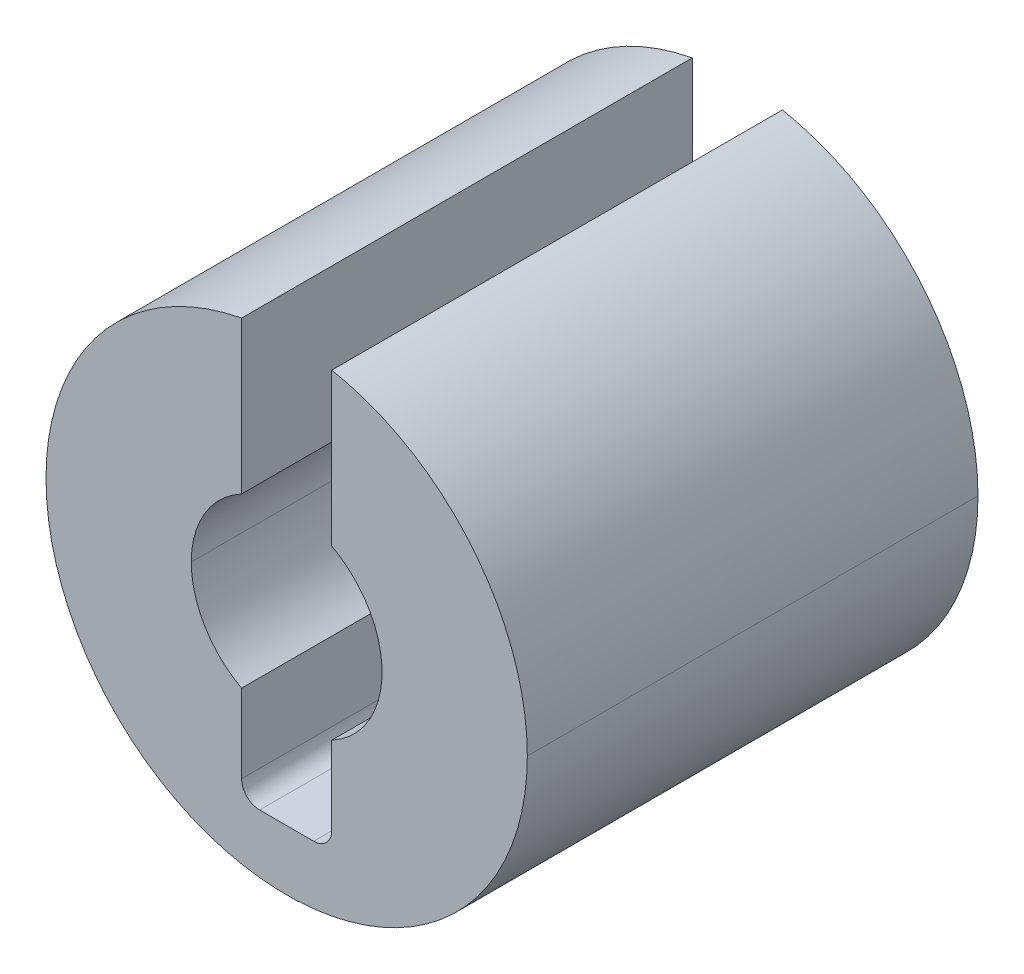
ISO-10303-21;
HEADER;
FILE_DESCRIPTION(('STEP AP214'),'2;1');
FILE_NAME('part.step','',(''),(''),'','','');
FILE_SCHEMA(('AUTOMOTIVE_DESIGN { 1 0 10303 214 1 1 1 1 }'));
ENDSEC;
DATA;
#1=APPLICATION_CONTEXT('core data for automotive mechanical design processes');
#2=APPLICATION_PROTOCOL_DEFINITION('international standard','automotive_design',2000,#1);
#3=PRODUCT_CONTEXT('',#1,'mechanical');
#4=PRODUCT('Part','Part','',(#3));
#5=PRODUCT_RELATED_PRODUCT_CATEGORY('part','',(#4));
#6=PRODUCT_DEFINITION_FORMATION('','',#4);
#7=PRODUCT_DEFINITION_CONTEXT('part definition',#1,'design');
#8=PRODUCT_DEFINITION('design','',#6,#7);
#9=PRODUCT_DEFINITION_SHAPE('','',#8);
#10=(LENGTH_UNIT() NAMED_UNIT(*) SI_UNIT(.MILLI.,.METRE.));
#11=(NAMED_UNIT(*) PLANE_ANGLE_UNIT() SI_UNIT($,.RADIAN.));
#12=(NAMED_UNIT(*) SI_UNIT($,.STERADIAN.) SOLID_ANGLE_UNIT());
#13=UNCERTAINTY_MEASURE_WITH_UNIT(LENGTH_MEASURE(1.E-05),#10,'distance_accuracy_value','');
#14=(GEOMETRIC_REPRESENTATION_CONTEXT(3) GLOBAL_UNCERTAINTY_ASSIGNED_CONTEXT((#13)) GLOBAL_UNIT_ASSIGNED_CONTEXT((#10,
#11,#12)) REPRESENTATION_CONTEXT('',''));
#15=CARTESIAN_POINT('',(0.,0.,0.));
#16=DIRECTION('',(0.,0.,1.));
#17=DIRECTION('',(1.,0.,0.));
#18=AXIS2_PLACEMENT_3D('',#15,#16,#17);
#19=CARTESIAN_POINT('',(0.45,-2.705,7.5));
#20=DIRECTION('',(0.,0.,1.));
#21=DIRECTION('',(1.,0.,0.));
#22=AXIS2_PLACEMENT_3D('',#19,#20,#21);
#23=CYLINDRICAL_SURFACE('',#22,0.3);
#24=CARTESIAN_POINT('',(0.45,-2.705,7.5));
#25=DIRECTION('',(0.,0.,-1.));
#26=DIRECTION('',(1.,0.,0.));
#27=AXIS2_PLACEMENT_3D('',#24,#25,#26);
#28=CIRCLE('',#27,0.3);
#29=CARTESIAN_POINT('',(0.75,-2.705,7.5));
#30=VERTEX_POINT('',#29);
#31=CARTESIAN_POINT('',(0.45,-3.005,7.5));
#32=VERTEX_POINT('',#31);
#33=EDGE_CURVE('E431',#30,#32,#28,.T.);
#34=ORIENTED_EDGE('',*,*,#33,.F.);
#35=DIRECTION('',(0.,0.,1.));
#36=VECTOR('',#35,1.);
#37=CARTESIAN_POINT('',(0.75,-2.705,7.5));
#38=LINE('',#37,#36);
#39=CARTESIAN_POINT('',(0.75,-2.705,0.));
#40=VERTEX_POINT('',#39);
#41=EDGE_CURVE('E302',#40,#30,#38,.T.);
#42=ORIENTED_EDGE('',*,*,#41,.F.);
#43=CARTESIAN_POINT('',(0.45,-2.705,0.));
#44=DIRECTION('',(0.,0.,1.));
#45=DIRECTION('',(1.,0.,0.));
#46=AXIS2_PLACEMENT_3D('',#43,#44,#45);
#47=CIRCLE('',#46,0.3);
#48=CARTESIAN_POINT('',(0.45,-3.005,0.));
#49=VERTEX_POINT('',#48);
#50=EDGE_CURVE('E11',#49,#40,#47,.T.);
#51=ORIENTED_EDGE('',*,*,#50,.F.);
#52=DIRECTION('',(0.,0.,-1.));
#53=VECTOR('',#52,1.);
#54=CARTESIAN_POINT('',(0.45,-3.005,0.));
#55=LINE('',#54,#53);
#56=EDGE_CURVE('E337',#32,#49,#55,.T.);
#57=ORIENTED_EDGE('',*,*,#56,.F.);
#58=EDGE_LOOP('',(#34,#42,#51,#57));
#59=FACE_BOUND('',#58,.T.);
#60=ADVANCED_FACE('F17',(#59),#23,.F.);
#61=CARTESIAN_POINT('',(-0.45,-2.705,7.5));
#62=DIRECTION('',(0.,0.,1.));
#63=DIRECTION('',(1.,0.,0.));
#64=AXIS2_PLACEMENT_3D('',#61,#62,#63);
#65=CYLINDRICAL_SURFACE('',#64,0.3);
#66=CARTESIAN_POINT('',(-0.45,-2.705,7.5));
#67=DIRECTION('',(0.,0.,-1.));
#68=DIRECTION('',(1.,0.,0.));
#69=AXIS2_PLACEMENT_3D('',#66,#67,#68);
#70=CIRCLE('',#69,0.3);
#71=CARTESIAN_POINT('',(-0.45,-3.005,7.5));
#72=VERTEX_POINT('',#71);
#73=CARTESIAN_POINT('',(-0.75,-2.705,7.5));
#74=VERTEX_POINT('',#73);
#75=EDGE_CURVE('E437',#72,#74,#70,.T.);
#76=ORIENTED_EDGE('',*,*,#75,.F.);
#77=DIRECTION('',(0.,0.,1.));
#78=VECTOR('',#77,1.);
#79=CARTESIAN_POINT('',(-0.45,-3.005,7.5));
#80=LINE('',#79,#78);
#81=CARTESIAN_POINT('',(-0.45,-3.005,0.));
#82=VERTEX_POINT('',#81);
#83=EDGE_CURVE('E323',#82,#72,#80,.T.);
#84=ORIENTED_EDGE('',*,*,#83,.F.);
#85=CARTESIAN_POINT('',(-0.45,-2.705,0.));
#86=DIRECTION('',(0.,0.,1.));
#87=DIRECTION('',(1.,0.,0.));
#88=AXIS2_PLACEMENT_3D('',#85,#86,#87);
#89=CIRCLE('',#88,0.3);
#90=CARTESIAN_POINT('',(-0.75,-2.705,0.));
#91=VERTEX_POINT('',#90);
#92=EDGE_CURVE('E27',#91,#82,#89,.T.);
#93=ORIENTED_EDGE('',*,*,#92,.F.);
#94=DIRECTION('',(0.,0.,-1.));
#95=VECTOR('',#94,1.);
#96=CARTESIAN_POINT('',(-0.75,-2.705,0.));
#97=LINE('',#96,#95);
#98=EDGE_CURVE('E351',#74,#91,#97,.T.);
#99=ORIENTED_EDGE('',*,*,#98,.F.);
#100=EDGE_LOOP('',(#76,#84,#93,#99));
#101=FACE_BOUND('',#100,.T.);
#102=ADVANCED_FACE('F584',(#101),#65,.F.);
#103=CARTESIAN_POINT('',(0.,0.,0.));
#104=DIRECTION('',(0.,0.,1.));
#105=DIRECTION('',(1.,0.,0.));
#106=AXIS2_PLACEMENT_3D('',#103,#104,#105);
#107=PLANE('',#106);
#108=CARTESIAN_POINT('',(0.,0.,0.));
#109=DIRECTION('',(0.,0.,-1.));
#110=DIRECTION('',(1.,0.,0.));
#111=AXIS2_PLACEMENT_3D('',#108,#109,#110);
#112=CIRCLE('',#111,1.5875);
#113=CARTESIAN_POINT('',(0.75,1.3991626960436,0.));
#114=VERTEX_POINT('',#113);
#115=CARTESIAN_POINT('',(0.75,-1.3991626960436,0.));
#116=VERTEX_POINT('',#115);
#117=EDGE_CURVE('E260',#114,#116,#112,.T.);
#118=ORIENTED_EDGE('',*,*,#117,.F.);
#119=DIRECTION('',(0.,-1.,0.));
#120=VECTOR('',#119,1.);
#121=CARTESIAN_POINT('',(0.75,1.3991626960436,0.));
#122=LINE('',#121,#120);
#123=CARTESIAN_POINT('',(0.75,3.93414857370689,0.));
#124=VERTEX_POINT('',#123);
#125=EDGE_CURVE('E420',#124,#114,#122,.T.);
#126=ORIENTED_EDGE('',*,*,#125,.F.);
#127=CARTESIAN_POINT('',(0.,0.,0.));
#128=DIRECTION('',(0.,0.,1.));
#129=DIRECTION('',(1.,0.,0.));
#130=AXIS2_PLACEMENT_3D('',#127,#128,#129);
#131=CIRCLE('',#130,4.005);
#132=CARTESIAN_POINT('',(4.005,0.,0.));
#133=VERTEX_POINT('',#132);
#134=EDGE_CURVE('E174',#133,#124,#131,.T.);
#135=ORIENTED_EDGE('',*,*,#134,.F.);
#136=CARTESIAN_POINT('',(0.,0.,0.));
#137=DIRECTION('',(0.,0.,1.));
#138=DIRECTION('',(1.,0.,0.));
#139=AXIS2_PLACEMENT_3D('',#136,#137,#138);
#140=CIRCLE('',#139,4.005);
#141=CARTESIAN_POINT('',(-4.005,0.,0.));
#142=VERTEX_POINT('',#141);
#143=EDGE_CURVE('E169',#142,#133,#140,.T.);
#144=ORIENTED_EDGE('',*,*,#143,.F.);
#145=CARTESIAN_POINT('',(0.,0.,0.));
#146=DIRECTION('',(0.,0.,1.));
#147=DIRECTION('',(1.,0.,0.));
#148=AXIS2_PLACEMENT_3D('',#145,#146,#147);
#149=CIRCLE('',#148,4.005);
#150=CARTESIAN_POINT('',(-0.75,3.93414857370689,0.));
#151=VERTEX_POINT('',#150);
#152=EDGE_CURVE('E55',#151,#142,#149,.T.);
#153=ORIENTED_EDGE('',*,*,#152,.F.);
#154=DIRECTION('',(0.,1.,0.));
#155=VECTOR('',#154,1.);
#156=CARTESIAN_POINT('',(-0.75,1.3991626960436,0.));
#157=LINE('',#156,#155);
#158=CARTESIAN_POINT('',(-0.75,1.3991626960436,0.));
#159=VERTEX_POINT('',#158);
#160=EDGE_CURVE('E388',#159,#151,#157,.T.);
#161=ORIENTED_EDGE('',*,*,#160,.F.);
#162=CARTESIAN_POINT('',(0.,0.,0.));
#163=DIRECTION('',(0.,0.,-1.));
#164=DIRECTION('',(1.,0.,0.));
#165=AXIS2_PLACEMENT_3D('',#162,#163,#164);
#166=CIRCLE('',#165,1.5875);
#167=CARTESIAN_POINT('',(-1.5875,0.,0.));
#168=VERTEX_POINT('',#167);
#169=EDGE_CURVE('E242',#168,#159,#166,.T.);
#170=ORIENTED_EDGE('',*,*,#169,.F.);
#171=CARTESIAN_POINT('',(0.,0.,0.));
#172=DIRECTION('',(0.,0.,-1.));
#173=DIRECTION('',(1.,0.,0.));
#174=AXIS2_PLACEMENT_3D('',#171,#172,#173);
#175=CIRCLE('',#174,1.5875);
#176=CARTESIAN_POINT('',(-0.75,-1.3991626960436,0.));
#177=VERTEX_POINT('',#176);
#178=EDGE_CURVE('E380',#177,#168,#175,.T.);
#179=ORIENTED_EDGE('',*,*,#178,.F.);
#180=DIRECTION('',(0.,1.,0.));
#181=VECTOR('',#180,1.);
#182=CARTESIAN_POINT('',(-0.75,-3.005,0.));
#183=LINE('',#182,#181);
#184=EDGE_CURVE('E358',#91,#177,#183,.T.);
#185=ORIENTED_EDGE('',*,*,#184,.F.);
#186=ORIENTED_EDGE('',*,*,#92,.T.);
#187=DIRECTION('',(-1.,0.,0.));
#188=VECTOR('',#187,1.);
#189=CARTESIAN_POINT('',(-0.75,-3.005,0.));
#190=LINE('',#189,#188);
#191=EDGE_CURVE('E316',#49,#82,#190,.T.);
#192=ORIENTED_EDGE('',*,*,#191,.F.);
#193=ORIENTED_EDGE('',*,*,#50,.T.);
#194=DIRECTION('',(0.,-1.,0.));
#195=VECTOR('',#194,1.);
#196=CARTESIAN_POINT('',(0.75,-3.005,0.));
#197=LINE('',#196,#195);
#198=EDGE_CURVE('E295',#116,#40,#197,.T.);
#199=ORIENTED_EDGE('',*,*,#198,.F.);
#200=EDGE_LOOP('',(#118,#126,#135,#144,#153,#161,#170,#179,#185,#186,#192,#193,#199));
#201=FACE_BOUND('',#200,.T.);
#202=ADVANCED_FACE('F575',(#201),#107,.F.);
#203=CARTESIAN_POINT('',(0.,0.,7.5));
#204=DIRECTION('',(0.,0.,1.));
#205=DIRECTION('',(1.,0.,0.));
#206=AXIS2_PLACEMENT_3D('',#203,#204,#205);
#207=PLANE('',#206);
#208=CARTESIAN_POINT('',(0.,0.,7.5));
#209=DIRECTION('',(0.,0.,-1.));
#210=DIRECTION('',(1.,0.,0.));
#211=AXIS2_PLACEMENT_3D('',#208,#209,#210);
#212=CIRCLE('',#211,1.5875);
#213=CARTESIAN_POINT('',(0.75,1.3991626960436,7.5));
#214=VERTEX_POINT('',#213);
#215=CARTESIAN_POINT('',(0.75,-1.3991626960436,7.5));
#216=VERTEX_POINT('',#215);
#217=EDGE_CURVE('E279',#214,#216,#212,.T.);
#218=ORIENTED_EDGE('',*,*,#217,.T.);
#219=DIRECTION('',(0.,-1.,0.));
#220=VECTOR('',#219,1.);
#221=CARTESIAN_POINT('',(0.75,-3.005,7.5));
#222=LINE('',#221,#220);
#223=EDGE_CURVE('E309',#216,#30,#222,.T.);
#224=ORIENTED_EDGE('',*,*,#223,.T.);
#225=ORIENTED_EDGE('',*,*,#33,.T.);
#226=DIRECTION('',(-1.,0.,0.));
#227=VECTOR('',#226,1.);
#228=CARTESIAN_POINT('',(-0.75,-3.005,7.5));
#229=LINE('',#228,#227);
#230=EDGE_CURVE('E331',#32,#72,#229,.T.);
#231=ORIENTED_EDGE('',*,*,#230,.T.);
#232=ORIENTED_EDGE('',*,*,#75,.T.);
#233=DIRECTION('',(0.,1.,0.));
#234=VECTOR('',#233,1.);
#235=CARTESIAN_POINT('',(-0.75,-3.005,7.5));
#236=LINE('',#235,#234);
#237=CARTESIAN_POINT('',(-0.75,-1.3991626960436,7.5));
#238=VERTEX_POINT('',#237);
#239=EDGE_CURVE('E344',#74,#238,#236,.T.);
#240=ORIENTED_EDGE('',*,*,#239,.T.);
#241=CARTESIAN_POINT('',(0.,0.,7.5));
#242=DIRECTION('',(0.,0.,-1.));
#243=DIRECTION('',(1.,0.,0.));
#244=AXIS2_PLACEMENT_3D('',#241,#242,#243);
#245=CIRCLE('',#244,1.5875);
#246=CARTESIAN_POINT('',(-1.5875,0.,7.5));
#247=VERTEX_POINT('',#246);
#248=EDGE_CURVE('E372',#238,#247,#245,.T.);
#249=ORIENTED_EDGE('',*,*,#248,.T.);
#250=CARTESIAN_POINT('',(0.,0.,7.5));
#251=DIRECTION('',(0.,0.,-1.));
#252=DIRECTION('',(1.,0.,0.));
#253=AXIS2_PLACEMENT_3D('',#250,#251,#252);
#254=CIRCLE('',#253,1.5875);
#255=CARTESIAN_POINT('',(-0.75,1.3991626960436,7.5));
#256=VERTEX_POINT('',#255);
#257=EDGE_CURVE('E223',#247,#256,#254,.T.);
#258=ORIENTED_EDGE('',*,*,#257,.T.);
#259=DIRECTION('',(0.,1.,0.));
#260=VECTOR('',#259,1.);
#261=CARTESIAN_POINT('',(-0.75,1.3991626960436,7.5));
#262=LINE('',#261,#260);
#263=CARTESIAN_POINT('',(-0.75,3.93414857370689,7.5));
#264=VERTEX_POINT('',#263);
#265=EDGE_CURVE('E403',#256,#264,#262,.T.);
#266=ORIENTED_EDGE('',*,*,#265,.T.);
#267=CARTESIAN_POINT('',(0.,0.,7.5));
#268=DIRECTION('',(0.,0.,1.));
#269=DIRECTION('',(1.,0.,0.));
#270=AXIS2_PLACEMENT_3D('',#267,#268,#269);
#271=CIRCLE('',#270,4.005);
#272=CARTESIAN_POINT('',(-4.005,0.,7.5));
#273=VERTEX_POINT('',#272);
#274=EDGE_CURVE('E41',#264,#273,#271,.T.);
#275=ORIENTED_EDGE('',*,*,#274,.T.);
#276=CARTESIAN_POINT('',(0.,0.,7.5));
#277=DIRECTION('',(0.,0.,1.));
#278=DIRECTION('',(1.,0.,0.));
#279=AXIS2_PLACEMENT_3D('',#276,#277,#278);
#280=CIRCLE('',#279,4.005);
#281=CARTESIAN_POINT('',(4.005,0.,7.5));
#282=VERTEX_POINT('',#281);
#283=EDGE_CURVE('E155',#273,#282,#280,.T.);
#284=ORIENTED_EDGE('',*,*,#283,.T.);
#285=CARTESIAN_POINT('',(0.,0.,7.5));
#286=DIRECTION('',(0.,0.,1.));
#287=DIRECTION('',(1.,0.,0.));
#288=AXIS2_PLACEMENT_3D('',#285,#286,#287);
#289=CIRCLE('',#288,4.005);
#290=CARTESIAN_POINT('',(0.75,3.93414857370689,7.5));
#291=VERTEX_POINT('',#290);
#292=EDGE_CURVE('E21',#282,#291,#289,.T.);
#293=ORIENTED_EDGE('',*,*,#292,.T.);
#294=DIRECTION('',(0.,-1.,0.));
#295=VECTOR('',#294,1.);
#296=CARTESIAN_POINT('',(0.75,1.3991626960436,7.5));
#297=LINE('',#296,#295);
#298=EDGE_CURVE('E148',#291,#214,#297,.T.);
#299=ORIENTED_EDGE('',*,*,#298,.T.);
#300=EDGE_LOOP('',(#218,#224,#225,#231,#232,#240,#249,#258,#266,#275,#284,#293,#299));
#301=FACE_BOUND('',#300,.T.);
#302=ADVANCED_FACE('F158',(#301),#207,.T.);
#303=CARTESIAN_POINT('',(0.75,1.3991626960436,7.5));
#304=DIRECTION('',(1.,0.,0.));
#305=DIRECTION('',(0.,1.,0.));
#306=AXIS2_PLACEMENT_3D('',#303,#304,#305);
#307=PLANE('',#306);
#308=ORIENTED_EDGE('',*,*,#125,.T.);
#309=DIRECTION('',(0.,0.,-1.));
#310=VECTOR('',#309,1.);
#311=CARTESIAN_POINT('',(0.75,1.3991626960436,7.5));
#312=LINE('',#311,#310);
#313=EDGE_CURVE('E287',#214,#114,#312,.T.);
#314=ORIENTED_EDGE('',*,*,#313,.F.);
#315=ORIENTED_EDGE('',*,*,#298,.F.);
#316=DIRECTION('',(0.,0.,-1.));
#317=VECTOR('',#316,1.);
#318=CARTESIAN_POINT('',(0.75,3.93414857370689,7.5));
#319=LINE('',#318,#317);
#320=EDGE_CURVE('E164',#291,#124,#319,.T.);
#321=ORIENTED_EDGE('',*,*,#320,.T.);
#322=EDGE_LOOP('',(#308,#314,#315,#321));
#323=FACE_BOUND('',#322,.T.);
#324=ADVANCED_FACE('F557',(#323),#307,.F.);
#325=CARTESIAN_POINT('',(0.,0.,7.5));
#326=DIRECTION('',(0.,0.,-1.));
#327=DIRECTION('',(-1.,0.,0.));
#328=AXIS2_PLACEMENT_3D('',#325,#326,#327);
#329=CYLINDRICAL_SURFACE('',#328,4.005);
#330=DIRECTION('',(0.,0.,-1.));
#331=VECTOR('',#330,1.);
#332=CARTESIAN_POINT('',(-4.005,0.,7.5));
#333=LINE('',#332,#331);
#334=EDGE_CURVE('E163',#273,#142,#333,.T.);
#335=ORIENTED_EDGE('',*,*,#334,.F.);
#336=ORIENTED_EDGE('',*,*,#274,.F.);
#337=DIRECTION('',(0.,0.,-1.));
#338=VECTOR('',#337,1.);
#339=CARTESIAN_POINT('',(-0.75,3.93414857370689,7.5));
#340=LINE('',#339,#338);
#341=EDGE_CURVE('E396',#264,#151,#340,.T.);
#342=ORIENTED_EDGE('',*,*,#341,.T.);
#343=ORIENTED_EDGE('',*,*,#152,.T.);
#344=EDGE_LOOP('',(#335,#336,#342,#343));
#345=FACE_BOUND('',#344,.T.);
#346=ADVANCED_FACE('F546',(#345),#329,.T.);
#347=CARTESIAN_POINT('',(-0.75,1.3991626960436,7.5));
#348=DIRECTION('',(-1.,0.,0.));
#349=DIRECTION('',(0.,0.,1.));
#350=AXIS2_PLACEMENT_3D('',#347,#348,#349);
#351=PLANE('',#350);
#352=ORIENTED_EDGE('',*,*,#160,.T.);
#353=ORIENTED_EDGE('',*,*,#341,.F.);
#354=ORIENTED_EDGE('',*,*,#265,.F.);
#355=DIRECTION('',(0.,0.,-1.));
#356=VECTOR('',#355,1.);
#357=CARTESIAN_POINT('',(-0.75,1.3991626960436,7.5));
#358=LINE('',#357,#356);
#359=EDGE_CURVE('E251',#256,#159,#358,.T.);
#360=ORIENTED_EDGE('',*,*,#359,.T.);
#361=EDGE_LOOP('',(#352,#353,#354,#360));
#362=FACE_BOUND('',#361,.T.);
#363=ADVANCED_FACE('F535',(#362),#351,.F.);
#364=CARTESIAN_POINT('',(0.,0.,7.5));
#365=DIRECTION('',(0.,0.,-1.));
#366=DIRECTION('',(-1.,0.,0.));
#367=AXIS2_PLACEMENT_3D('',#364,#365,#366);
#368=CYLINDRICAL_SURFACE('',#367,1.5875);
#369=DIRECTION('',(0.,0.,-1.));
#370=VECTOR('',#369,1.);
#371=CARTESIAN_POINT('',(-1.5875,0.,7.5));
#372=LINE('',#371,#370);
#373=EDGE_CURVE('E232',#247,#168,#372,.T.);
#374=ORIENTED_EDGE('',*,*,#373,.F.);
#375=ORIENTED_EDGE('',*,*,#248,.F.);
#376=DIRECTION('',(0.,0.,-1.));
#377=VECTOR('',#376,1.);
#378=CARTESIAN_POINT('',(-0.75,-1.3991626960436,7.5));
#379=LINE('',#378,#377);
#380=EDGE_CURVE('E365',#238,#177,#379,.T.);
#381=ORIENTED_EDGE('',*,*,#380,.T.);
#382=ORIENTED_EDGE('',*,*,#178,.T.);
#383=EDGE_LOOP('',(#374,#375,#381,#382));
#384=FACE_BOUND('',#383,.T.);
#385=ADVANCED_FACE('F525',(#384),#368,.F.);
#386=CARTESIAN_POINT('',(-0.75,-3.005,7.5));
#387=DIRECTION('',(-1.,0.,0.));
#388=DIRECTION('',(0.,0.,1.));
#389=AXIS2_PLACEMENT_3D('',#386,#387,#388);
#390=PLANE('',#389);
#391=ORIENTED_EDGE('',*,*,#239,.F.);
#392=ORIENTED_EDGE('',*,*,#98,.T.);
#393=ORIENTED_EDGE('',*,*,#184,.T.);
#394=ORIENTED_EDGE('',*,*,#380,.F.);
#395=EDGE_LOOP('',(#391,#392,#393,#394));
#396=FACE_BOUND('',#395,.T.);
#397=ADVANCED_FACE('F514',(#396),#390,.F.);
#398=CARTESIAN_POINT('',(-0.75,-3.005,7.5));
#399=DIRECTION('',(0.,-1.,0.));
#400=DIRECTION('',(0.,0.,-1.));
#401=AXIS2_PLACEMENT_3D('',#398,#399,#400);
#402=PLANE('',#401);
#403=ORIENTED_EDGE('',*,*,#191,.T.);
#404=ORIENTED_EDGE('',*,*,#83,.T.);
#405=ORIENTED_EDGE('',*,*,#230,.F.);
#406=ORIENTED_EDGE('',*,*,#56,.T.);
#407=EDGE_LOOP('',(#403,#404,#405,#406));
#408=FACE_BOUND('',#407,.T.);
#409=ADVANCED_FACE('F503',(#408),#402,.F.);
#410=CARTESIAN_POINT('',(0.75,-3.005,7.5));
#411=DIRECTION('',(1.,0.,0.));
#412=DIRECTION('',(0.,1.,0.));
#413=AXIS2_PLACEMENT_3D('',#410,#411,#412);
#414=PLANE('',#413);
#415=ORIENTED_EDGE('',*,*,#198,.T.);
#416=ORIENTED_EDGE('',*,*,#41,.T.);
#417=ORIENTED_EDGE('',*,*,#223,.F.);
#418=DIRECTION('',(0.,0.,-1.));
#419=VECTOR('',#418,1.);
#420=CARTESIAN_POINT('',(0.75,-1.3991626960436,7.5));
#421=LINE('',#420,#419);
#422=EDGE_CURVE('E270',#216,#116,#421,.T.);
#423=ORIENTED_EDGE('',*,*,#422,.T.);
#424=EDGE_LOOP('',(#415,#416,#417,#423));
#425=FACE_BOUND('',#424,.T.);
#426=ADVANCED_FACE('F19',(#425),#414,.F.);
#427=CARTESIAN_POINT('',(0.,0.,7.5));
#428=DIRECTION('',(0.,0.,-1.));
#429=DIRECTION('',(-1.,0.,0.));
#430=AXIS2_PLACEMENT_3D('',#427,#428,#429);
#431=CYLINDRICAL_SURFACE('',#430,1.5875);
#432=ORIENTED_EDGE('',*,*,#117,.T.);
#433=ORIENTED_EDGE('',*,*,#422,.F.);
#434=ORIENTED_EDGE('',*,*,#217,.F.);
#435=ORIENTED_EDGE('',*,*,#313,.T.);
#436=EDGE_LOOP('',(#432,#433,#434,#435));
#437=FACE_BOUND('',#436,.T.);
#438=ADVANCED_FACE('F481',(#437),#431,.F.);
#439=CARTESIAN_POINT('',(0.,0.,7.5));
#440=DIRECTION('',(0.,0.,-1.));
#441=DIRECTION('',(-1.,0.,0.));
#442=AXIS2_PLACEMENT_3D('',#439,#440,#441);
#443=CYLINDRICAL_SURFACE('',#442,1.5875);
#444=ORIENTED_EDGE('',*,*,#257,.F.);
#445=ORIENTED_EDGE('',*,*,#373,.T.);
#446=ORIENTED_EDGE('',*,*,#169,.T.);
#447=ORIENTED_EDGE('',*,*,#359,.F.);
#448=EDGE_LOOP('',(#444,#445,#446,#447));
#449=FACE_BOUND('',#448,.T.);
#450=ADVANCED_FACE('F469',(#449),#443,.F.);
#451=CARTESIAN_POINT('',(0.,0.,7.5));
#452=DIRECTION('',(0.,0.,-1.));
#453=DIRECTION('',(-1.,0.,0.));
#454=AXIS2_PLACEMENT_3D('',#451,#452,#453);
#455=CYLINDRICAL_SURFACE('',#454,4.005);
#456=DIRECTION('',(0.,0.,-1.));
#457=VECTOR('',#456,1.);
#458=CARTESIAN_POINT('',(4.005,0.,7.5));
#459=LINE('',#458,#457);
#460=EDGE_CURVE('E167',#282,#133,#459,.T.);
#461=ORIENTED_EDGE('',*,*,#460,.F.);
#462=ORIENTED_EDGE('',*,*,#283,.F.);
#463=ORIENTED_EDGE('',*,*,#334,.T.);
#464=ORIENTED_EDGE('',*,*,#143,.T.);
#465=EDGE_LOOP('',(#461,#462,#463,#464));
#466=FACE_BOUND('',#465,.T.);
#467=ADVANCED_FACE('F168',(#466),#455,.T.);
#468=CARTESIAN_POINT('',(0.,0.,7.5));
#469=DIRECTION('',(0.,0.,-1.));
#470=DIRECTION('',(-1.,0.,0.));
#471=AXIS2_PLACEMENT_3D('',#468,#469,#470);
#472=CYLINDRICAL_SURFACE('',#471,4.005);
#473=ORIENTED_EDGE('',*,*,#292,.F.);
#474=ORIENTED_EDGE('',*,*,#460,.T.);
#475=ORIENTED_EDGE('',*,*,#134,.T.);
#476=ORIENTED_EDGE('',*,*,#320,.F.);
#477=EDGE_LOOP('',(#473,#474,#475,#476));
#478=FACE_BOUND('',#477,.T.);
#479=ADVANCED_FACE('F176',(#478),#472,.T.);
#480=CLOSED_SHELL('',(#60,#102,#202,#302,#324,#346,#363,#385,#397,#409,#426,#438,#450,#467,#479));
#481=MANIFOLD_SOLID_BREP('B1',#480);
#482=ADVANCED_BREP_SHAPE_REPRESENTATION('',(#18,#481),#14);
#483=SHAPE_DEFINITION_REPRESENTATION(#9,#482);
ENDSEC;
END-ISO-10303-21;
